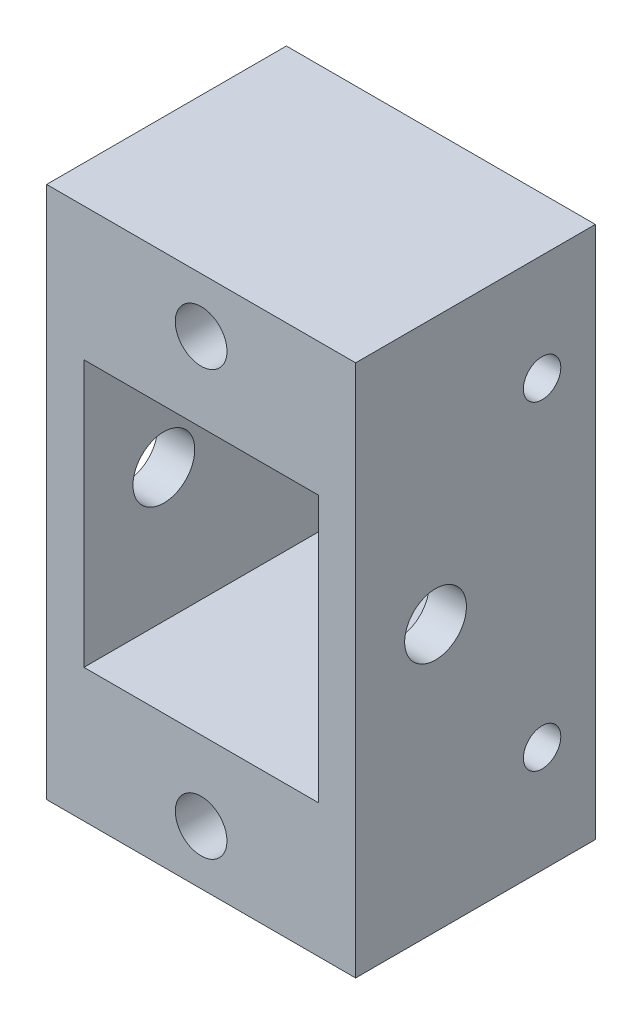
ISO-10303-21;
HEADER;
FILE_DESCRIPTION(('STEP AP214'),'2;1');
FILE_NAME('part.step','',(''),(''),'','','');
FILE_SCHEMA(('AUTOMOTIVE_DESIGN { 1 0 10303 214 1 1 1 1 }'));
ENDSEC;
DATA;
#1=APPLICATION_CONTEXT('core data for automotive mechanical design processes');
#2=APPLICATION_PROTOCOL_DEFINITION('international standard','automotive_design',2000,#1);
#3=PRODUCT_CONTEXT('',#1,'mechanical');
#4=PRODUCT('Part','Part','',(#3));
#5=PRODUCT_RELATED_PRODUCT_CATEGORY('part','',(#4));
#6=PRODUCT_DEFINITION_FORMATION('','',#4);
#7=PRODUCT_DEFINITION_CONTEXT('part definition',#1,'design');
#8=PRODUCT_DEFINITION('design','',#6,#7);
#9=PRODUCT_DEFINITION_SHAPE('','',#8);
#10=(LENGTH_UNIT() NAMED_UNIT(*) SI_UNIT(.MILLI.,.METRE.));
#11=(NAMED_UNIT(*) PLANE_ANGLE_UNIT() SI_UNIT($,.RADIAN.));
#12=(NAMED_UNIT(*) SI_UNIT($,.STERADIAN.) SOLID_ANGLE_UNIT());
#13=UNCERTAINTY_MEASURE_WITH_UNIT(LENGTH_MEASURE(1.E-05),#10,'distance_accuracy_value','');
#14=(GEOMETRIC_REPRESENTATION_CONTEXT(3) GLOBAL_UNCERTAINTY_ASSIGNED_CONTEXT((#13)) GLOBAL_UNIT_ASSIGNED_CONTEXT((#10,
#11,#12)) REPRESENTATION_CONTEXT('',''));
#15=CARTESIAN_POINT('',(0.,0.,0.));
#16=DIRECTION('',(0.,0.,1.));
#17=DIRECTION('',(1.,0.,0.));
#18=AXIS2_PLACEMENT_3D('',#15,#16,#17);
#19=CARTESIAN_POINT('',(0.,0.,22.5));
#20=DIRECTION('',(0.,0.,1.));
#21=DIRECTION('',(1.,0.,0.));
#22=AXIS2_PLACEMENT_3D('',#19,#20,#21);
#23=PLANE('',#22);
#24=CARTESIAN_POINT('',(0.,19.9,22.5));
#25=DIRECTION('',(0.,0.,1.));
#26=DIRECTION('',(1.,0.,0.));
#27=AXIS2_PLACEMENT_3D('',#24,#25,#26);
#28=CIRCLE('',#27,2.425);
#29=CARTESIAN_POINT('',(2.425,19.9,22.5));
#30=VERTEX_POINT('',#29);
#31=EDGE_CURVE('E141',#30,#30,#28,.T.);
#32=ORIENTED_EDGE('',*,*,#31,.F.);
#33=EDGE_LOOP('',(#32));
#34=FACE_BOUND('',#33,.T.);
#35=DIRECTION('',(0.,-1.,0.));
#36=VECTOR('',#35,1.);
#37=CARTESIAN_POINT('',(-14.5,25.,22.5));
#38=LINE('',#37,#36);
#39=CARTESIAN_POINT('',(-14.5,25.,22.5));
#40=VERTEX_POINT('',#39);
#41=CARTESIAN_POINT('',(-14.5,-25.,22.5));
#42=VERTEX_POINT('',#41);
#43=EDGE_CURVE('E157',#40,#42,#38,.T.);
#44=ORIENTED_EDGE('',*,*,#43,.T.);
#45=DIRECTION('',(1.,0.,0.));
#46=VECTOR('',#45,1.);
#47=CARTESIAN_POINT('',(-14.5,-25.,22.5));
#48=LINE('',#47,#46);
#49=CARTESIAN_POINT('',(14.5,-25.,22.5));
#50=VERTEX_POINT('',#49);
#51=EDGE_CURVE('E161',#42,#50,#48,.T.);
#52=ORIENTED_EDGE('',*,*,#51,.T.);
#53=DIRECTION('',(0.,1.,0.));
#54=VECTOR('',#53,1.);
#55=CARTESIAN_POINT('',(14.5,25.,22.5));
#56=LINE('',#55,#54);
#57=CARTESIAN_POINT('',(14.5,25.,22.5));
#58=VERTEX_POINT('',#57);
#59=EDGE_CURVE('E165',#50,#58,#56,.T.);
#60=ORIENTED_EDGE('',*,*,#59,.T.);
#61=DIRECTION('',(-1.,0.,0.));
#62=VECTOR('',#61,1.);
#63=CARTESIAN_POINT('',(-14.5,25.,22.5));
#64=LINE('',#63,#62);
#65=EDGE_CURVE('E168',#58,#40,#64,.T.);
#66=ORIENTED_EDGE('',*,*,#65,.T.);
#67=EDGE_LOOP('',(#44,#52,#60,#66));
#68=FACE_BOUND('',#67,.T.);
#69=DIRECTION('',(1.,0.,0.));
#70=VECTOR('',#69,1.);
#71=CARTESIAN_POINT('',(-11.,-12.5,22.5));
#72=LINE('',#71,#70);
#73=CARTESIAN_POINT('',(-11.,-12.5,22.5));
#74=VERTEX_POINT('',#73);
#75=CARTESIAN_POINT('',(11.,-12.5,22.5));
#76=VERTEX_POINT('',#75);
#77=EDGE_CURVE('E115',#74,#76,#72,.T.);
#78=ORIENTED_EDGE('',*,*,#77,.F.);
#79=DIRECTION('',(0.,-1.,0.));
#80=VECTOR('',#79,1.);
#81=CARTESIAN_POINT('',(-11.,12.5,22.5));
#82=LINE('',#81,#80);
#83=CARTESIAN_POINT('',(-11.,12.5,22.5));
#84=VERTEX_POINT('',#83);
#85=EDGE_CURVE('E106',#84,#74,#82,.T.);
#86=ORIENTED_EDGE('',*,*,#85,.F.);
#87=DIRECTION('',(-1.,0.,0.));
#88=VECTOR('',#87,1.);
#89=CARTESIAN_POINT('',(-11.,12.5,22.5));
#90=LINE('',#89,#88);
#91=CARTESIAN_POINT('',(11.,12.5,22.5));
#92=VERTEX_POINT('',#91);
#93=EDGE_CURVE('E133',#92,#84,#90,.T.);
#94=ORIENTED_EDGE('',*,*,#93,.F.);
#95=DIRECTION('',(0.,1.,0.));
#96=VECTOR('',#95,1.);
#97=CARTESIAN_POINT('',(11.,12.5,22.5));
#98=LINE('',#97,#96);
#99=EDGE_CURVE('E129',#76,#92,#98,.T.);
#100=ORIENTED_EDGE('',*,*,#99,.F.);
#101=EDGE_LOOP('',(#78,#86,#94,#100));
#102=FACE_BOUND('',#101,.T.);
#103=CARTESIAN_POINT('',(0.,-19.9,22.5));
#104=DIRECTION('',(0.,0.,1.));
#105=DIRECTION('',(-1.,0.,0.));
#106=AXIS2_PLACEMENT_3D('',#103,#104,#105);
#107=CIRCLE('',#106,2.425);
#108=CARTESIAN_POINT('',(-2.425,-19.9,22.5));
#109=VERTEX_POINT('',#108);
#110=EDGE_CURVE('E267',#109,#109,#107,.T.);
#111=ORIENTED_EDGE('',*,*,#110,.F.);
#112=EDGE_LOOP('',(#111));
#113=FACE_BOUND('',#112,.T.);
#114=ADVANCED_FACE('F39',(#34,#68,#102,#113),#23,.T.);
#115=CARTESIAN_POINT('',(0.,0.,0.));
#116=DIRECTION('',(0.,0.,1.));
#117=DIRECTION('',(1.,0.,0.));
#118=AXIS2_PLACEMENT_3D('',#115,#116,#117);
#119=PLANE('',#118);
#120=DIRECTION('',(0.,-1.,0.));
#121=VECTOR('',#120,1.);
#122=CARTESIAN_POINT('',(-14.5,25.,0.));
#123=LINE('',#122,#121);
#124=CARTESIAN_POINT('',(-14.5,25.,0.));
#125=VERTEX_POINT('',#124);
#126=CARTESIAN_POINT('',(-14.5,-25.,0.));
#127=VERTEX_POINT('',#126);
#128=EDGE_CURVE('E124',#125,#127,#123,.T.);
#129=ORIENTED_EDGE('',*,*,#128,.F.);
#130=DIRECTION('',(-1.,0.,0.));
#131=VECTOR('',#130,1.);
#132=CARTESIAN_POINT('',(-14.5,25.,0.));
#133=LINE('',#132,#131);
#134=CARTESIAN_POINT('',(14.5,25.,0.));
#135=VERTEX_POINT('',#134);
#136=EDGE_CURVE('E162',#135,#125,#133,.T.);
#137=ORIENTED_EDGE('',*,*,#136,.F.);
#138=DIRECTION('',(0.,1.,0.));
#139=VECTOR('',#138,1.);
#140=CARTESIAN_POINT('',(14.5,25.,0.));
#141=LINE('',#140,#139);
#142=CARTESIAN_POINT('',(14.5,-25.,0.));
#143=VERTEX_POINT('',#142);
#144=EDGE_CURVE('E178',#143,#135,#141,.T.);
#145=ORIENTED_EDGE('',*,*,#144,.F.);
#146=DIRECTION('',(1.,0.,0.));
#147=VECTOR('',#146,1.);
#148=CARTESIAN_POINT('',(-14.5,-25.,0.));
#149=LINE('',#148,#147);
#150=EDGE_CURVE('E175',#127,#143,#149,.T.);
#151=ORIENTED_EDGE('',*,*,#150,.F.);
#152=EDGE_LOOP('',(#129,#137,#145,#151));
#153=FACE_BOUND('',#152,.T.);
#154=DIRECTION('',(0.,-1.,0.));
#155=VECTOR('',#154,1.);
#156=CARTESIAN_POINT('',(-11.,12.5,0.));
#157=LINE('',#156,#155);
#158=CARTESIAN_POINT('',(-11.,12.5,0.));
#159=VERTEX_POINT('',#158);
#160=CARTESIAN_POINT('',(-11.,-12.5,0.));
#161=VERTEX_POINT('',#160);
#162=EDGE_CURVE('E64',#159,#161,#157,.T.);
#163=ORIENTED_EDGE('',*,*,#162,.T.);
#164=DIRECTION('',(1.,0.,0.));
#165=VECTOR('',#164,1.);
#166=CARTESIAN_POINT('',(-11.,-12.5,0.));
#167=LINE('',#166,#165);
#168=CARTESIAN_POINT('',(11.,-12.5,0.));
#169=VERTEX_POINT('',#168);
#170=EDGE_CURVE('E122',#161,#169,#167,.T.);
#171=ORIENTED_EDGE('',*,*,#170,.T.);
#172=DIRECTION('',(0.,1.,0.));
#173=VECTOR('',#172,1.);
#174=CARTESIAN_POINT('',(11.,12.5,0.));
#175=LINE('',#174,#173);
#176=CARTESIAN_POINT('',(11.,12.5,0.));
#177=VERTEX_POINT('',#176);
#178=EDGE_CURVE('E144',#169,#177,#175,.T.);
#179=ORIENTED_EDGE('',*,*,#178,.T.);
#180=DIRECTION('',(-1.,0.,0.));
#181=VECTOR('',#180,1.);
#182=CARTESIAN_POINT('',(-11.,12.5,0.));
#183=LINE('',#182,#181);
#184=EDGE_CURVE('E116',#177,#159,#183,.T.);
#185=ORIENTED_EDGE('',*,*,#184,.T.);
#186=EDGE_LOOP('',(#163,#171,#179,#185));
#187=FACE_BOUND('',#186,.T.);
#188=CARTESIAN_POINT('',(0.,19.9,0.));
#189=DIRECTION('',(0.,0.,1.));
#190=DIRECTION('',(1.,0.,0.));
#191=AXIS2_PLACEMENT_3D('',#188,#189,#190);
#192=CIRCLE('',#191,2.425);
#193=CARTESIAN_POINT('',(2.425,19.9,0.));
#194=VERTEX_POINT('',#193);
#195=EDGE_CURVE('E271',#194,#194,#192,.T.);
#196=ORIENTED_EDGE('',*,*,#195,.T.);
#197=EDGE_LOOP('',(#196));
#198=FACE_BOUND('',#197,.T.);
#199=CARTESIAN_POINT('',(0.,-19.9,0.));
#200=DIRECTION('',(0.,0.,1.));
#201=DIRECTION('',(-1.,0.,0.));
#202=AXIS2_PLACEMENT_3D('',#199,#200,#201);
#203=CIRCLE('',#202,2.425);
#204=CARTESIAN_POINT('',(-2.425,-19.9,0.));
#205=VERTEX_POINT('',#204);
#206=EDGE_CURVE('E266',#205,#205,#203,.T.);
#207=ORIENTED_EDGE('',*,*,#206,.T.);
#208=EDGE_LOOP('',(#207));
#209=FACE_BOUND('',#208,.T.);
#210=ADVANCED_FACE('F202',(#153,#187,#198,#209),#119,.F.);
#211=CARTESIAN_POINT('',(-14.5,25.,22.5));
#212=DIRECTION('',(1.,0.,0.));
#213=DIRECTION('',(0.,0.,-1.));
#214=AXIS2_PLACEMENT_3D('',#211,#212,#213);
#215=PLANE('',#214);
#216=CARTESIAN_POINT('',(-14.5,0.,15.));
#217=DIRECTION('',(1.,0.,0.));
#218=DIRECTION('',(0.,0.,-1.));
#219=AXIS2_PLACEMENT_3D('',#216,#217,#218);
#220=CIRCLE('',#219,2.9);
#221=CARTESIAN_POINT('',(-14.5,0.,12.1));
#222=VERTEX_POINT('',#221);
#223=EDGE_CURVE('E246',#222,#222,#220,.T.);
#224=ORIENTED_EDGE('',*,*,#223,.T.);
#225=EDGE_LOOP('',(#224));
#226=FACE_BOUND('',#225,.T.);
#227=CARTESIAN_POINT('',(-14.5,15.,5.));
#228=DIRECTION('',(1.,0.,0.));
#229=DIRECTION('',(0.,0.,-1.));
#230=AXIS2_PLACEMENT_3D('',#227,#228,#229);
#231=CIRCLE('',#230,1.755);
#232=CARTESIAN_POINT('',(-14.5,15.,3.245));
#233=VERTEX_POINT('',#232);
#234=EDGE_CURVE('E262',#233,#233,#231,.T.);
#235=ORIENTED_EDGE('',*,*,#234,.T.);
#236=EDGE_LOOP('',(#235));
#237=FACE_BOUND('',#236,.T.);
#238=CARTESIAN_POINT('',(-14.5,-15.,5.));
#239=DIRECTION('',(1.,0.,0.));
#240=DIRECTION('',(0.,0.,-1.));
#241=AXIS2_PLACEMENT_3D('',#238,#239,#240);
#242=CIRCLE('',#241,1.755);
#243=CARTESIAN_POINT('',(-14.5,-15.,3.245));
#244=VERTEX_POINT('',#243);
#245=EDGE_CURVE('E251',#244,#244,#242,.T.);
#246=ORIENTED_EDGE('',*,*,#245,.T.);
#247=EDGE_LOOP('',(#246));
#248=FACE_BOUND('',#247,.T.);
#249=ORIENTED_EDGE('',*,*,#128,.T.);
#250=DIRECTION('',(0.,0.,-1.));
#251=VECTOR('',#250,1.);
#252=CARTESIAN_POINT('',(-14.5,-25.,22.5));
#253=LINE('',#252,#251);
#254=EDGE_CURVE('E11',#42,#127,#253,.T.);
#255=ORIENTED_EDGE('',*,*,#254,.F.);
#256=ORIENTED_EDGE('',*,*,#43,.F.);
#257=DIRECTION('',(0.,0.,-1.));
#258=VECTOR('',#257,1.);
#259=CARTESIAN_POINT('',(-14.5,25.,22.5));
#260=LINE('',#259,#258);
#261=EDGE_CURVE('E171',#40,#125,#260,.T.);
#262=ORIENTED_EDGE('',*,*,#261,.T.);
#263=EDGE_LOOP('',(#249,#255,#256,#262));
#264=FACE_BOUND('',#263,.T.);
#265=ADVANCED_FACE('F41',(#226,#237,#248,#264),#215,.F.);
#266=CARTESIAN_POINT('',(-14.5,-25.,22.5));
#267=DIRECTION('',(0.,1.,0.));
#268=DIRECTION('',(0.,0.,1.));
#269=AXIS2_PLACEMENT_3D('',#266,#267,#268);
#270=PLANE('',#269);
#271=ORIENTED_EDGE('',*,*,#150,.T.);
#272=DIRECTION('',(0.,0.,-1.));
#273=VECTOR('',#272,1.);
#274=CARTESIAN_POINT('',(14.5,-25.,22.5));
#275=LINE('',#274,#273);
#276=EDGE_CURVE('E49',#50,#143,#275,.T.);
#277=ORIENTED_EDGE('',*,*,#276,.F.);
#278=ORIENTED_EDGE('',*,*,#51,.F.);
#279=ORIENTED_EDGE('',*,*,#254,.T.);
#280=EDGE_LOOP('',(#271,#277,#278,#279));
#281=FACE_BOUND('',#280,.T.);
#282=ADVANCED_FACE('F212',(#281),#270,.F.);
#283=CARTESIAN_POINT('',(14.5,25.,22.5));
#284=DIRECTION('',(-1.,0.,0.));
#285=DIRECTION('',(0.,0.,1.));
#286=AXIS2_PLACEMENT_3D('',#283,#284,#285);
#287=PLANE('',#286);
#288=CARTESIAN_POINT('',(14.5,0.,15.));
#289=DIRECTION('',(1.,0.,0.));
#290=DIRECTION('',(0.,0.,-1.));
#291=AXIS2_PLACEMENT_3D('',#288,#289,#290);
#292=CIRCLE('',#291,2.9);
#293=CARTESIAN_POINT('',(14.5,0.,12.1));
#294=VERTEX_POINT('',#293);
#295=EDGE_CURVE('E254',#294,#294,#292,.T.);
#296=ORIENTED_EDGE('',*,*,#295,.F.);
#297=EDGE_LOOP('',(#296));
#298=FACE_BOUND('',#297,.T.);
#299=CARTESIAN_POINT('',(14.5,15.,5.));
#300=DIRECTION('',(1.,0.,0.));
#301=DIRECTION('',(0.,0.,-1.));
#302=AXIS2_PLACEMENT_3D('',#299,#300,#301);
#303=CIRCLE('',#302,1.755);
#304=CARTESIAN_POINT('',(14.5,15.,3.245));
#305=VERTEX_POINT('',#304);
#306=EDGE_CURVE('E314',#305,#305,#303,.T.);
#307=ORIENTED_EDGE('',*,*,#306,.F.);
#308=EDGE_LOOP('',(#307));
#309=FACE_BOUND('',#308,.T.);
#310=CARTESIAN_POINT('',(14.5,-15.,5.));
#311=DIRECTION('',(1.,0.,0.));
#312=DIRECTION('',(0.,0.,-1.));
#313=AXIS2_PLACEMENT_3D('',#310,#311,#312);
#314=CIRCLE('',#313,1.755);
#315=CARTESIAN_POINT('',(14.5,-15.,3.245));
#316=VERTEX_POINT('',#315);
#317=EDGE_CURVE('E256',#316,#316,#314,.T.);
#318=ORIENTED_EDGE('',*,*,#317,.F.);
#319=EDGE_LOOP('',(#318));
#320=FACE_BOUND('',#319,.T.);
#321=ORIENTED_EDGE('',*,*,#144,.T.);
#322=DIRECTION('',(0.,0.,-1.));
#323=VECTOR('',#322,1.);
#324=CARTESIAN_POINT('',(14.5,25.,22.5));
#325=LINE('',#324,#323);
#326=EDGE_CURVE('E186',#58,#135,#325,.T.);
#327=ORIENTED_EDGE('',*,*,#326,.F.);
#328=ORIENTED_EDGE('',*,*,#59,.F.);
#329=ORIENTED_EDGE('',*,*,#276,.T.);
#330=EDGE_LOOP('',(#321,#327,#328,#329));
#331=FACE_BOUND('',#330,.T.);
#332=ADVANCED_FACE('F196',(#298,#309,#320,#331),#287,.F.);
#333=CARTESIAN_POINT('',(-14.5,25.,22.5));
#334=DIRECTION('',(0.,-1.,0.));
#335=DIRECTION('',(0.,0.,-1.));
#336=AXIS2_PLACEMENT_3D('',#333,#334,#335);
#337=PLANE('',#336);
#338=ORIENTED_EDGE('',*,*,#136,.T.);
#339=ORIENTED_EDGE('',*,*,#261,.F.);
#340=ORIENTED_EDGE('',*,*,#65,.F.);
#341=ORIENTED_EDGE('',*,*,#326,.T.);
#342=EDGE_LOOP('',(#338,#339,#340,#341));
#343=FACE_BOUND('',#342,.T.);
#344=ADVANCED_FACE('F206',(#343),#337,.F.);
#345=CARTESIAN_POINT('',(-11.,12.5,22.5));
#346=DIRECTION('',(1.,0.,0.));
#347=DIRECTION('',(0.,0.,-1.));
#348=AXIS2_PLACEMENT_3D('',#345,#346,#347);
#349=PLANE('',#348);
#350=CARTESIAN_POINT('',(-11.,0.,15.));
#351=DIRECTION('',(1.,0.,0.));
#352=DIRECTION('',(0.,0.,-1.));
#353=AXIS2_PLACEMENT_3D('',#350,#351,#352);
#354=CIRCLE('',#353,2.9);
#355=CARTESIAN_POINT('',(-11.,0.,12.1));
#356=VERTEX_POINT('',#355);
#357=EDGE_CURVE('E243',#356,#356,#354,.T.);
#358=ORIENTED_EDGE('',*,*,#357,.F.);
#359=EDGE_LOOP('',(#358));
#360=FACE_BOUND('',#359,.T.);
#361=ORIENTED_EDGE('',*,*,#162,.F.);
#362=DIRECTION('',(0.,0.,-1.));
#363=VECTOR('',#362,1.);
#364=CARTESIAN_POINT('',(-11.,12.5,22.5));
#365=LINE('',#364,#363);
#366=EDGE_CURVE('E110',#84,#159,#365,.T.);
#367=ORIENTED_EDGE('',*,*,#366,.F.);
#368=ORIENTED_EDGE('',*,*,#85,.T.);
#369=DIRECTION('',(0.,0.,-1.));
#370=VECTOR('',#369,1.);
#371=CARTESIAN_POINT('',(-11.,-12.5,22.5));
#372=LINE('',#371,#370);
#373=EDGE_CURVE('E109',#74,#161,#372,.T.);
#374=ORIENTED_EDGE('',*,*,#373,.T.);
#375=EDGE_LOOP('',(#361,#367,#368,#374));
#376=FACE_BOUND('',#375,.T.);
#377=ADVANCED_FACE('F108',(#360,#376),#349,.T.);
#378=CARTESIAN_POINT('',(-11.,-12.5,22.5));
#379=DIRECTION('',(0.,1.,0.));
#380=DIRECTION('',(0.,0.,1.));
#381=AXIS2_PLACEMENT_3D('',#378,#379,#380);
#382=PLANE('',#381);
#383=ORIENTED_EDGE('',*,*,#170,.F.);
#384=ORIENTED_EDGE('',*,*,#373,.F.);
#385=ORIENTED_EDGE('',*,*,#77,.T.);
#386=DIRECTION('',(0.,0.,-1.));
#387=VECTOR('',#386,1.);
#388=CARTESIAN_POINT('',(11.,-12.5,22.5));
#389=LINE('',#388,#387);
#390=EDGE_CURVE('E125',#76,#169,#389,.T.);
#391=ORIENTED_EDGE('',*,*,#390,.T.);
#392=EDGE_LOOP('',(#383,#384,#385,#391));
#393=FACE_BOUND('',#392,.T.);
#394=ADVANCED_FACE('F119',(#393),#382,.T.);
#395=CARTESIAN_POINT('',(11.,12.5,22.5));
#396=DIRECTION('',(-1.,0.,0.));
#397=DIRECTION('',(0.,-1.,0.));
#398=AXIS2_PLACEMENT_3D('',#395,#396,#397);
#399=PLANE('',#398);
#400=CARTESIAN_POINT('',(11.,0.,15.));
#401=DIRECTION('',(-1.,0.,0.));
#402=DIRECTION('',(0.,-1.,0.));
#403=AXIS2_PLACEMENT_3D('',#400,#401,#402);
#404=CIRCLE('',#403,2.9);
#405=CARTESIAN_POINT('',(11.,-2.9,15.));
#406=VERTEX_POINT('',#405);
#407=EDGE_CURVE('E43',#406,#406,#404,.T.);
#408=ORIENTED_EDGE('',*,*,#407,.F.);
#409=EDGE_LOOP('',(#408));
#410=FACE_BOUND('',#409,.T.);
#411=ORIENTED_EDGE('',*,*,#178,.F.);
#412=ORIENTED_EDGE('',*,*,#390,.F.);
#413=ORIENTED_EDGE('',*,*,#99,.T.);
#414=DIRECTION('',(0.,0.,-1.));
#415=VECTOR('',#414,1.);
#416=CARTESIAN_POINT('',(11.,12.5,22.5));
#417=LINE('',#416,#415);
#418=EDGE_CURVE('E56',#92,#177,#417,.T.);
#419=ORIENTED_EDGE('',*,*,#418,.T.);
#420=EDGE_LOOP('',(#411,#412,#413,#419));
#421=FACE_BOUND('',#420,.T.);
#422=ADVANCED_FACE('F240',(#410,#421),#399,.T.);
#423=CARTESIAN_POINT('',(-11.,12.5,22.5));
#424=DIRECTION('',(0.,-1.,0.));
#425=DIRECTION('',(0.,0.,-1.));
#426=AXIS2_PLACEMENT_3D('',#423,#424,#425);
#427=PLANE('',#426);
#428=ORIENTED_EDGE('',*,*,#184,.F.);
#429=ORIENTED_EDGE('',*,*,#418,.F.);
#430=ORIENTED_EDGE('',*,*,#93,.T.);
#431=ORIENTED_EDGE('',*,*,#366,.T.);
#432=EDGE_LOOP('',(#428,#429,#430,#431));
#433=FACE_BOUND('',#432,.T.);
#434=ADVANCED_FACE('F286',(#433),#427,.T.);
#435=CARTESIAN_POINT('',(0.,19.9,22.5));
#436=DIRECTION('',(0.,0.,-1.));
#437=DIRECTION('',(-1.,0.,0.));
#438=AXIS2_PLACEMENT_3D('',#435,#436,#437);
#439=CYLINDRICAL_SURFACE('',#438,2.425);
#440=ORIENTED_EDGE('',*,*,#31,.T.);
#441=EDGE_LOOP('',(#440));
#442=FACE_BOUND('',#441,.T.);
#443=ORIENTED_EDGE('',*,*,#195,.F.);
#444=EDGE_LOOP('',(#443));
#445=FACE_BOUND('',#444,.T.);
#446=ADVANCED_FACE('F283',(#442,#445),#439,.F.);
#447=CARTESIAN_POINT('',(0.,-19.9,22.5));
#448=DIRECTION('',(0.,0.,-1.));
#449=DIRECTION('',(-1.,0.,0.));
#450=AXIS2_PLACEMENT_3D('',#447,#448,#449);
#451=CYLINDRICAL_SURFACE('',#450,2.425);
#452=ORIENTED_EDGE('',*,*,#110,.T.);
#453=EDGE_LOOP('',(#452));
#454=FACE_BOUND('',#453,.T.);
#455=ORIENTED_EDGE('',*,*,#206,.F.);
#456=EDGE_LOOP('',(#455));
#457=FACE_BOUND('',#456,.T.);
#458=ADVANCED_FACE('F285',(#454,#457),#451,.F.);
#459=CARTESIAN_POINT('',(-15.5,0.,15.));
#460=DIRECTION('',(1.,0.,0.));
#461=DIRECTION('',(0.,0.,-1.));
#462=AXIS2_PLACEMENT_3D('',#459,#460,#461);
#463=CYLINDRICAL_SURFACE('',#462,2.9);
#464=ORIENTED_EDGE('',*,*,#407,.T.);
#465=EDGE_LOOP('',(#464));
#466=FACE_BOUND('',#465,.T.);
#467=ORIENTED_EDGE('',*,*,#295,.T.);
#468=EDGE_LOOP('',(#467));
#469=FACE_BOUND('',#468,.T.);
#470=ADVANCED_FACE('F293',(#466,#469),#463,.F.);
#471=ORIENTED_EDGE('',*,*,#357,.T.);
#472=EDGE_LOOP('',(#471));
#473=FACE_BOUND('',#472,.T.);
#474=ORIENTED_EDGE('',*,*,#223,.F.);
#475=EDGE_LOOP('',(#474));
#476=FACE_BOUND('',#475,.T.);
#477=ADVANCED_FACE('F309',(#473,#476),#463,.F.);
#478=CARTESIAN_POINT('',(-15.5,-15.,5.));
#479=DIRECTION('',(1.,0.,0.));
#480=DIRECTION('',(0.,0.,-1.));
#481=AXIS2_PLACEMENT_3D('',#478,#479,#480);
#482=CYLINDRICAL_SURFACE('',#481,1.755);
#483=ORIENTED_EDGE('',*,*,#317,.T.);
#484=EDGE_LOOP('',(#483));
#485=FACE_BOUND('',#484,.T.);
#486=ORIENTED_EDGE('',*,*,#245,.F.);
#487=EDGE_LOOP('',(#486));
#488=FACE_BOUND('',#487,.T.);
#489=ADVANCED_FACE('F324',(#485,#488),#482,.F.);
#490=CARTESIAN_POINT('',(-15.5,15.,5.));
#491=DIRECTION('',(1.,0.,0.));
#492=DIRECTION('',(0.,0.,-1.));
#493=AXIS2_PLACEMENT_3D('',#490,#491,#492);
#494=CYLINDRICAL_SURFACE('',#493,1.755);
#495=ORIENTED_EDGE('',*,*,#306,.T.);
#496=EDGE_LOOP('',(#495));
#497=FACE_BOUND('',#496,.T.);
#498=ORIENTED_EDGE('',*,*,#234,.F.);
#499=EDGE_LOOP('',(#498));
#500=FACE_BOUND('',#499,.T.);
#501=ADVANCED_FACE('F328',(#497,#500),#494,.F.);
#502=CLOSED_SHELL('',(#114,#210,#265,#282,#332,#344,#377,#394,#422,#434,#446,#458,#470,#477,
#489,#501));
#503=MANIFOLD_SOLID_BREP('B2',#502);
#504=ADVANCED_BREP_SHAPE_REPRESENTATION('',(#18,#503),#14);
#505=SHAPE_DEFINITION_REPRESENTATION(#9,#504);
ENDSEC;
END-ISO-10303-21;
